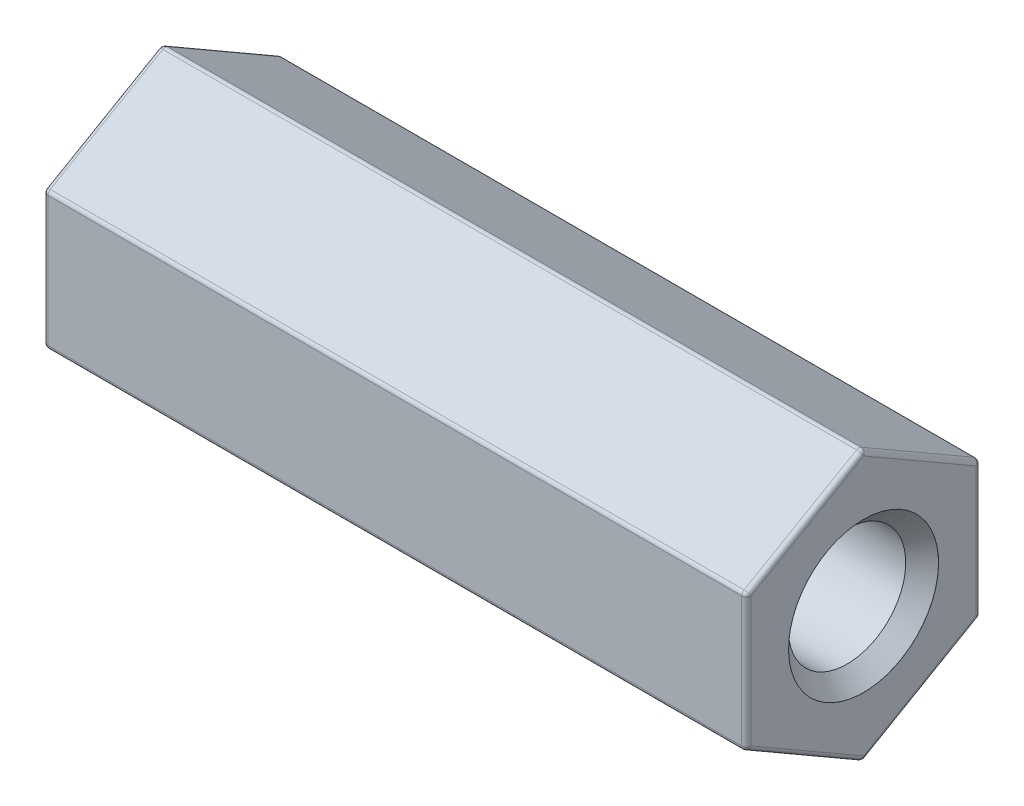
ISO-10303-21;
HEADER;
FILE_DESCRIPTION(('STEP AP214'),'2;1');
FILE_NAME('part.step','',(''),(''),'','','');
FILE_SCHEMA(('AUTOMOTIVE_DESIGN { 1 0 10303 214 1 1 1 1 }'));
ENDSEC;
DATA;
#1=APPLICATION_CONTEXT('core data for automotive mechanical design processes');
#2=APPLICATION_PROTOCOL_DEFINITION('international standard','automotive_design',2000,#1);
#3=PRODUCT_CONTEXT('',#1,'mechanical');
#4=PRODUCT('Part','Part','',(#3));
#5=PRODUCT_RELATED_PRODUCT_CATEGORY('part','',(#4));
#6=PRODUCT_DEFINITION_FORMATION('','',#4);
#7=PRODUCT_DEFINITION_CONTEXT('part definition',#1,'design');
#8=PRODUCT_DEFINITION('design','',#6,#7);
#9=PRODUCT_DEFINITION_SHAPE('','',#8);
#10=(LENGTH_UNIT() NAMED_UNIT(*) SI_UNIT(.MILLI.,.METRE.));
#11=(NAMED_UNIT(*) PLANE_ANGLE_UNIT() SI_UNIT($,.RADIAN.));
#12=(NAMED_UNIT(*) SI_UNIT($,.STERADIAN.) SOLID_ANGLE_UNIT());
#13=UNCERTAINTY_MEASURE_WITH_UNIT(LENGTH_MEASURE(1.E-05),#10,'distance_accuracy_value','');
#14=(GEOMETRIC_REPRESENTATION_CONTEXT(3) GLOBAL_UNCERTAINTY_ASSIGNED_CONTEXT((#13)) GLOBAL_UNIT_ASSIGNED_CONTEXT((#10,
#11,#12)) REPRESENTATION_CONTEXT('',''));
#15=CARTESIAN_POINT('',(0.,0.,0.));
#16=DIRECTION('',(0.,0.,1.));
#17=DIRECTION('',(1.,0.,0.));
#18=AXIS2_PLACEMENT_3D('',#15,#16,#17);
#19=CARTESIAN_POINT('',(15.,-1.3856406460551,-2.4));
#20=DIRECTION('',(-1.,0.,0.));
#21=DIRECTION('',(0.,0.,1.));
#22=AXIS2_PLACEMENT_3D('',#19,#20,#21);
#23=CYLINDRICAL_SURFACE('',#22,0.0999999999999998);
#24=CARTESIAN_POINT('',(14.9,-1.3856406460551,-2.4));
#25=DIRECTION('',(1.,0.,0.));
#26=DIRECTION('',(0.,0.,-1.));
#27=AXIS2_PLACEMENT_3D('',#24,#25,#26);
#28=CIRCLE('',#27,0.0999999999999998);
#29=CARTESIAN_POINT('',(14.9,-1.4722431864336,-2.44999999999991));
#30=VERTEX_POINT('',#29);
#31=CARTESIAN_POINT('',(14.9,-1.3856406460551,-2.5));
#32=VERTEX_POINT('',#31);
#33=EDGE_CURVE('E156',#30,#32,#28,.T.);
#34=ORIENTED_EDGE('',*,*,#33,.F.);
#35=DIRECTION('',(1.,0.,0.));
#36=VECTOR('',#35,1.);
#37=CARTESIAN_POINT('',(15.,-1.47224318643355,-2.45));
#38=LINE('',#37,#36);
#39=CARTESIAN_POINT('',(0.0999999999999994,-1.47224318643355,-2.45));
#40=VERTEX_POINT('',#39);
#41=EDGE_CURVE('E261',#30,#40,#38,.F.);
#42=ORIENTED_EDGE('',*,*,#41,.T.);
#43=CARTESIAN_POINT('',(0.0999999999999994,-1.3856406460551,-2.4));
#44=DIRECTION('',(-1.,0.,0.));
#45=DIRECTION('',(0.,0.,1.));
#46=AXIS2_PLACEMENT_3D('',#43,#44,#45);
#47=CIRCLE('',#46,0.0999999999999998);
#48=CARTESIAN_POINT('',(0.0999999999999994,-1.3856406460551,-2.5));
#49=VERTEX_POINT('',#48);
#50=EDGE_CURVE('E307',#40,#49,#47,.F.);
#51=ORIENTED_EDGE('',*,*,#50,.T.);
#52=DIRECTION('',(1.,0.,0.));
#53=VECTOR('',#52,1.);
#54=CARTESIAN_POINT('',(15.,-1.3856406460551,-2.5));
#55=LINE('',#54,#53);
#56=EDGE_CURVE('E253',#49,#32,#55,.T.);
#57=ORIENTED_EDGE('',*,*,#56,.T.);
#58=EDGE_LOOP('',(#34,#42,#51,#57));
#59=FACE_BOUND('',#58,.T.);
#60=ADVANCED_FACE('F16',(#59),#23,.T.);
#61=CARTESIAN_POINT('',(15.,1.3856406460551,-2.4));
#62=DIRECTION('',(-1.,0.,0.));
#63=DIRECTION('',(0.,0.,1.));
#64=AXIS2_PLACEMENT_3D('',#61,#62,#63);
#65=CYLINDRICAL_SURFACE('',#64,0.0999999999999998);
#66=CARTESIAN_POINT('',(14.9,1.3856406460551,-2.4));
#67=DIRECTION('',(1.,0.,0.));
#68=DIRECTION('',(0.,0.,-1.));
#69=AXIS2_PLACEMENT_3D('',#66,#67,#68);
#70=CIRCLE('',#69,0.0999999999999998);
#71=CARTESIAN_POINT('',(14.9,1.3856406460551,-2.5));
#72=VERTEX_POINT('',#71);
#73=CARTESIAN_POINT('',(14.9,1.47224318643355,-2.45));
#74=VERTEX_POINT('',#73);
#75=EDGE_CURVE('E147',#72,#74,#70,.T.);
#76=ORIENTED_EDGE('',*,*,#75,.F.);
#77=DIRECTION('',(1.,0.,0.));
#78=VECTOR('',#77,1.);
#79=CARTESIAN_POINT('',(15.,1.3856406460551,-2.5));
#80=LINE('',#79,#78);
#81=CARTESIAN_POINT('',(0.0999999999999994,1.3856406460551,-2.5));
#82=VERTEX_POINT('',#81);
#83=EDGE_CURVE('E256',#72,#82,#80,.F.);
#84=ORIENTED_EDGE('',*,*,#83,.T.);
#85=CARTESIAN_POINT('',(0.0999999999999994,1.3856406460551,-2.4));
#86=DIRECTION('',(1.,0.,0.));
#87=DIRECTION('',(0.,0.,-1.));
#88=AXIS2_PLACEMENT_3D('',#85,#86,#87);
#89=CIRCLE('',#88,0.0999999999999998);
#90=CARTESIAN_POINT('',(0.0999999999999994,1.4722431864334,-2.45000000000025));
#91=VERTEX_POINT('',#90);
#92=EDGE_CURVE('E171',#91,#82,#89,.F.);
#93=ORIENTED_EDGE('',*,*,#92,.F.);
#94=DIRECTION('',(1.,0.,0.));
#95=VECTOR('',#94,1.);
#96=CARTESIAN_POINT('',(15.,1.47224318643355,-2.45));
#97=LINE('',#96,#95);
#98=EDGE_CURVE('E169',#91,#74,#97,.T.);
#99=ORIENTED_EDGE('',*,*,#98,.T.);
#100=EDGE_LOOP('',(#76,#84,#93,#99));
#101=FACE_BOUND('',#100,.T.);
#102=ADVANCED_FACE('F170',(#101),#65,.T.);
#103=CARTESIAN_POINT('',(15.,2.77128129211021,0.));
#104=DIRECTION('',(-1.,0.,0.));
#105=DIRECTION('',(0.,0.,1.));
#106=AXIS2_PLACEMENT_3D('',#103,#104,#105);
#107=CYLINDRICAL_SURFACE('',#106,0.1);
#108=CARTESIAN_POINT('',(14.9,2.77128129211021,0.));
#109=DIRECTION('',(1.,0.,0.));
#110=DIRECTION('',(0.,0.,-1.));
#111=AXIS2_PLACEMENT_3D('',#108,#109,#110);
#112=CIRCLE('',#111,0.1);
#113=CARTESIAN_POINT('',(14.9,2.85788383248861,-0.0500000000000736));
#114=VERTEX_POINT('',#113);
#115=CARTESIAN_POINT('',(14.9,2.85788383248865,0.0500000000000005));
#116=VERTEX_POINT('',#115);
#117=EDGE_CURVE('E283',#114,#116,#112,.T.);
#118=ORIENTED_EDGE('',*,*,#117,.F.);
#119=DIRECTION('',(1.,0.,0.));
#120=VECTOR('',#119,1.);
#121=CARTESIAN_POINT('',(15.,2.85788383248865,-0.0499999999999997));
#122=LINE('',#121,#120);
#123=CARTESIAN_POINT('',(0.0999999999999994,2.85788383248865,-0.0499999999999997));
#124=VERTEX_POINT('',#123);
#125=EDGE_CURVE('E140',#114,#124,#122,.F.);
#126=ORIENTED_EDGE('',*,*,#125,.T.);
#127=CARTESIAN_POINT('',(0.0999999999999994,2.77128129211021,0.));
#128=DIRECTION('',(1.,0.,0.));
#129=DIRECTION('',(0.,0.,-1.));
#130=AXIS2_PLACEMENT_3D('',#127,#128,#129);
#131=CIRCLE('',#130,0.1);
#132=CARTESIAN_POINT('',(0.0999999999999994,2.85788383248828,0.0500000000006368));
#133=VERTEX_POINT('',#132);
#134=EDGE_CURVE('E173',#133,#124,#131,.F.);
#135=ORIENTED_EDGE('',*,*,#134,.F.);
#136=DIRECTION('',(1.,0.,0.));
#137=VECTOR('',#136,1.);
#138=CARTESIAN_POINT('',(15.,2.85788383248865,0.0500000000000006));
#139=LINE('',#138,#137);
#140=EDGE_CURVE('E497',#133,#116,#139,.T.);
#141=ORIENTED_EDGE('',*,*,#140,.T.);
#142=EDGE_LOOP('',(#118,#126,#135,#141));
#143=FACE_BOUND('',#142,.T.);
#144=ADVANCED_FACE('F494',(#143),#107,.T.);
#145=CARTESIAN_POINT('',(15.,1.3856406460551,2.4));
#146=DIRECTION('',(-1.,0.,0.));
#147=DIRECTION('',(0.,0.,1.));
#148=AXIS2_PLACEMENT_3D('',#145,#146,#147);
#149=CYLINDRICAL_SURFACE('',#148,0.0999999999999998);
#150=CARTESIAN_POINT('',(14.9,1.3856406460551,2.4));
#151=DIRECTION('',(1.,0.,0.));
#152=DIRECTION('',(0.,0.,-1.));
#153=AXIS2_PLACEMENT_3D('',#150,#151,#152);
#154=CIRCLE('',#153,0.0999999999999998);
#155=CARTESIAN_POINT('',(14.9,1.47224318643357,2.44999999999996));
#156=VERTEX_POINT('',#155);
#157=CARTESIAN_POINT('',(14.9,1.3856406460551,2.5));
#158=VERTEX_POINT('',#157);
#159=EDGE_CURVE('E264',#156,#158,#154,.T.);
#160=ORIENTED_EDGE('',*,*,#159,.F.);
#161=DIRECTION('',(1.,0.,0.));
#162=VECTOR('',#161,1.);
#163=CARTESIAN_POINT('',(15.,1.47224318643355,2.45));
#164=LINE('',#163,#162);
#165=CARTESIAN_POINT('',(0.0999999999999994,1.47224318643355,2.45));
#166=VERTEX_POINT('',#165);
#167=EDGE_CURVE('E235',#156,#166,#164,.F.);
#168=ORIENTED_EDGE('',*,*,#167,.T.);
#169=CARTESIAN_POINT('',(0.0999999999999994,1.3856406460551,2.4));
#170=DIRECTION('',(1.,0.,0.));
#171=DIRECTION('',(0.,0.,-1.));
#172=AXIS2_PLACEMENT_3D('',#169,#170,#171);
#173=CIRCLE('',#172,0.0999999999999998);
#174=CARTESIAN_POINT('',(0.0999999999999994,1.38564064605472,2.5));
#175=VERTEX_POINT('',#174);
#176=EDGE_CURVE('E214',#175,#166,#173,.F.);
#177=ORIENTED_EDGE('',*,*,#176,.F.);
#178=DIRECTION('',(-1.,0.,0.));
#179=VECTOR('',#178,1.);
#180=CARTESIAN_POINT('',(15.,1.3856406460551,2.5));
#181=LINE('',#180,#179);
#182=EDGE_CURVE('E211',#175,#158,#181,.F.);
#183=ORIENTED_EDGE('',*,*,#182,.T.);
#184=EDGE_LOOP('',(#160,#168,#177,#183));
#185=FACE_BOUND('',#184,.T.);
#186=ADVANCED_FACE('F686',(#185),#149,.T.);
#187=CARTESIAN_POINT('',(15.,-2.77128129211021,0.));
#188=DIRECTION('',(-1.,0.,0.));
#189=DIRECTION('',(0.,0.,1.));
#190=AXIS2_PLACEMENT_3D('',#187,#188,#189);
#191=CYLINDRICAL_SURFACE('',#190,0.1);
#192=CARTESIAN_POINT('',(14.9,-2.77128129211021,0.));
#193=DIRECTION('',(1.,0.,0.));
#194=DIRECTION('',(0.,0.,-1.));
#195=AXIS2_PLACEMENT_3D('',#192,#193,#194);
#196=CIRCLE('',#195,0.1);
#197=CARTESIAN_POINT('',(14.9,-2.85788383248887,0.0499999999996142));
#198=VERTEX_POINT('',#197);
#199=CARTESIAN_POINT('',(14.9,-2.85788383248865,-0.0499999999999997));
#200=VERTEX_POINT('',#199);
#201=EDGE_CURVE('E288',#198,#200,#196,.T.);
#202=ORIENTED_EDGE('',*,*,#201,.F.);
#203=DIRECTION('',(1.,0.,0.));
#204=VECTOR('',#203,1.);
#205=CARTESIAN_POINT('',(15.,-2.85788383248865,0.0500000000000006));
#206=LINE('',#205,#204);
#207=CARTESIAN_POINT('',(0.0999999999999994,-2.85788383248865,0.0500000000000006));
#208=VERTEX_POINT('',#207);
#209=EDGE_CURVE('E205',#198,#208,#206,.F.);
#210=ORIENTED_EDGE('',*,*,#209,.T.);
#211=CARTESIAN_POINT('',(0.0999999999999994,-2.77128129211021,0.));
#212=DIRECTION('',(1.,0.,0.));
#213=DIRECTION('',(0.,0.,-1.));
#214=AXIS2_PLACEMENT_3D('',#211,#212,#213);
#215=CIRCLE('',#214,0.1);
#216=CARTESIAN_POINT('',(0.0999999999999994,-2.85788383248875,-0.0499999999998183));
#217=VERTEX_POINT('',#216);
#218=EDGE_CURVE('E206',#217,#208,#215,.F.);
#219=ORIENTED_EDGE('',*,*,#218,.F.);
#220=DIRECTION('',(1.,0.,0.));
#221=VECTOR('',#220,1.);
#222=CARTESIAN_POINT('',(15.,-2.85788383248865,-0.0499999999999997));
#223=LINE('',#222,#221);
#224=EDGE_CURVE('E258',#217,#200,#223,.T.);
#225=ORIENTED_EDGE('',*,*,#224,.T.);
#226=EDGE_LOOP('',(#202,#210,#219,#225));
#227=FACE_BOUND('',#226,.T.);
#228=ADVANCED_FACE('F470',(#227),#191,.T.);
#229=CARTESIAN_POINT('',(15.,-1.3856406460551,2.4));
#230=DIRECTION('',(-1.,0.,0.));
#231=DIRECTION('',(0.,0.,1.));
#232=AXIS2_PLACEMENT_3D('',#229,#230,#231);
#233=CYLINDRICAL_SURFACE('',#232,0.0999999999999998);
#234=CARTESIAN_POINT('',(14.9,-1.3856406460551,2.4));
#235=DIRECTION('',(1.,0.,0.));
#236=DIRECTION('',(0.,0.,-1.));
#237=AXIS2_PLACEMENT_3D('',#234,#235,#236);
#238=CIRCLE('',#237,0.0999999999999998);
#239=CARTESIAN_POINT('',(14.9,-1.38564064605529,2.5));
#240=VERTEX_POINT('',#239);
#241=CARTESIAN_POINT('',(14.9,-1.47224318643355,2.45));
#242=VERTEX_POINT('',#241);
#243=EDGE_CURVE('E284',#240,#242,#238,.T.);
#244=ORIENTED_EDGE('',*,*,#243,.F.);
#245=DIRECTION('',(-1.,0.,0.));
#246=VECTOR('',#245,1.);
#247=CARTESIAN_POINT('',(15.,-1.3856406460551,2.5));
#248=LINE('',#247,#246);
#249=CARTESIAN_POINT('',(0.0999999999999994,-1.3856406460551,2.5));
#250=VERTEX_POINT('',#249);
#251=EDGE_CURVE('E208',#240,#250,#248,.T.);
#252=ORIENTED_EDGE('',*,*,#251,.T.);
#253=CARTESIAN_POINT('',(0.0999999999999994,-1.3856406460551,2.4));
#254=DIRECTION('',(-1.,0.,0.));
#255=DIRECTION('',(0.,0.,1.));
#256=AXIS2_PLACEMENT_3D('',#253,#254,#255);
#257=CIRCLE('',#256,0.0999999999999998);
#258=CARTESIAN_POINT('',(0.0999999999999994,-1.47224318643352,2.45000000000004));
#259=VERTEX_POINT('',#258);
#260=EDGE_CURVE('E157',#250,#259,#257,.F.);
#261=ORIENTED_EDGE('',*,*,#260,.T.);
#262=DIRECTION('',(1.,0.,0.));
#263=VECTOR('',#262,1.);
#264=CARTESIAN_POINT('',(15.,-1.47224318643355,2.45));
#265=LINE('',#264,#263);
#266=EDGE_CURVE('E166',#259,#242,#265,.T.);
#267=ORIENTED_EDGE('',*,*,#266,.T.);
#268=EDGE_LOOP('',(#244,#252,#261,#267));
#269=FACE_BOUND('',#268,.T.);
#270=ADVANCED_FACE('F476',(#269),#233,.T.);
#271=CARTESIAN_POINT('',(14.9,1.3856406460551,-2.4));
#272=DIRECTION('',(1.,0.,0.));
#273=DIRECTION('',(0.,0.,-1.));
#274=AXIS2_PLACEMENT_3D('',#271,#272,#273);
#275=SPHERICAL_SURFACE('',#274,0.1);
#276=ORIENTED_EDGE('',*,*,#75,.T.);
#277=CARTESIAN_POINT('',(14.9,1.3856406460551,-2.4));
#278=DIRECTION('',(0.,0.5,0.866025403784439));
#279=DIRECTION('',(0.,-0.866025403784439,0.5));
#280=AXIS2_PLACEMENT_3D('',#277,#278,#279);
#281=CIRCLE('',#280,0.0999999999999998);
#282=CARTESIAN_POINT('',(15.,1.3856406460551,-2.4));
#283=VERTEX_POINT('',#282);
#284=EDGE_CURVE('E150',#283,#74,#281,.T.);
#285=ORIENTED_EDGE('',*,*,#284,.F.);
#286=CARTESIAN_POINT('',(14.9,1.3856406460551,-2.4));
#287=DIRECTION('',(0.,1.,0.));
#288=DIRECTION('',(0.,0.,1.));
#289=AXIS2_PLACEMENT_3D('',#286,#287,#288);
#290=CIRCLE('',#289,0.0999999999999998);
#291=EDGE_CURVE('E152',#72,#283,#290,.F.);
#292=ORIENTED_EDGE('',*,*,#291,.F.);
#293=EDGE_LOOP('',(#276,#285,#292));
#294=FACE_BOUND('',#293,.T.);
#295=ADVANCED_FACE('F149',(#294),#275,.T.);
#296=CARTESIAN_POINT('',(14.9,-1.3856406460551,-2.4));
#297=DIRECTION('',(1.,0.,0.));
#298=DIRECTION('',(0.,0.,-1.));
#299=AXIS2_PLACEMENT_3D('',#296,#297,#298);
#300=SPHERICAL_SURFACE('',#299,0.1);
#301=CARTESIAN_POINT('',(14.9,-1.3856406460551,-2.4));
#302=DIRECTION('',(0.,1.,0.));
#303=DIRECTION('',(0.,0.,1.));
#304=AXIS2_PLACEMENT_3D('',#301,#302,#303);
#305=CIRCLE('',#304,0.0999999999999998);
#306=CARTESIAN_POINT('',(15.,-1.3856406460551,-2.4));
#307=VERTEX_POINT('',#306);
#308=EDGE_CURVE('E178',#307,#32,#305,.T.);
#309=ORIENTED_EDGE('',*,*,#308,.F.);
#310=CARTESIAN_POINT('',(14.9,-1.3856406460551,-2.4));
#311=DIRECTION('',(0.,0.5,-0.866025403784439));
#312=DIRECTION('',(0.,0.866025403784439,0.5));
#313=AXIS2_PLACEMENT_3D('',#310,#311,#312);
#314=CIRCLE('',#313,0.1);
#315=EDGE_CURVE('E430',#30,#307,#314,.F.);
#316=ORIENTED_EDGE('',*,*,#315,.F.);
#317=ORIENTED_EDGE('',*,*,#33,.T.);
#318=EDGE_LOOP('',(#309,#316,#317));
#319=FACE_BOUND('',#318,.T.);
#320=ADVANCED_FACE('F295',(#319),#300,.T.);
#321=CARTESIAN_POINT('',(14.9,-2.77128129211021,0.));
#322=DIRECTION('',(1.,0.,0.));
#323=DIRECTION('',(0.,0.,-1.));
#324=AXIS2_PLACEMENT_3D('',#321,#322,#323);
#325=SPHERICAL_SURFACE('',#324,0.1);
#326=CARTESIAN_POINT('',(14.9,-2.77128129211021,0.));
#327=DIRECTION('',(0.,0.5,-0.866025403784439));
#328=DIRECTION('',(0.,0.866025403784439,0.5));
#329=AXIS2_PLACEMENT_3D('',#326,#327,#328);
#330=CIRCLE('',#329,0.1);
#331=CARTESIAN_POINT('',(15.,-2.7712812921102,0.));
#332=VERTEX_POINT('',#331);
#333=EDGE_CURVE('E427',#332,#200,#330,.T.);
#334=ORIENTED_EDGE('',*,*,#333,.F.);
#335=CARTESIAN_POINT('',(14.9,-2.77128129211021,0.));
#336=DIRECTION('',(0.,-0.5,-0.866025403784439));
#337=DIRECTION('',(0.,0.866025403784439,-0.5));
#338=AXIS2_PLACEMENT_3D('',#335,#336,#337);
#339=CIRCLE('',#338,0.0999999999999998);
#340=EDGE_CURVE('E422',#198,#332,#339,.F.);
#341=ORIENTED_EDGE('',*,*,#340,.F.);
#342=ORIENTED_EDGE('',*,*,#201,.T.);
#343=EDGE_LOOP('',(#334,#341,#342));
#344=FACE_BOUND('',#343,.T.);
#345=ADVANCED_FACE('F292',(#344),#325,.T.);
#346=CARTESIAN_POINT('',(14.9,-1.3856406460551,2.4));
#347=DIRECTION('',(1.,0.,0.));
#348=DIRECTION('',(0.,0.,-1.));
#349=AXIS2_PLACEMENT_3D('',#346,#347,#348);
#350=SPHERICAL_SURFACE('',#349,0.1);
#351=CARTESIAN_POINT('',(14.9,-1.3856406460551,2.4));
#352=DIRECTION('',(0.,-0.5,-0.866025403784439));
#353=DIRECTION('',(0.,0.866025403784439,-0.5));
#354=AXIS2_PLACEMENT_3D('',#351,#352,#353);
#355=CIRCLE('',#354,0.0999999999999998);
#356=CARTESIAN_POINT('',(15.,-1.3856406460551,2.4));
#357=VERTEX_POINT('',#356);
#358=EDGE_CURVE('E419',#357,#242,#355,.T.);
#359=ORIENTED_EDGE('',*,*,#358,.F.);
#360=CARTESIAN_POINT('',(14.9,-1.3856406460551,2.4));
#361=DIRECTION('',(0.,-1.,0.));
#362=DIRECTION('',(1.,0.,0.));
#363=AXIS2_PLACEMENT_3D('',#360,#361,#362);
#364=CIRCLE('',#363,0.0999999999999994);
#365=EDGE_CURVE('E408',#240,#357,#364,.F.);
#366=ORIENTED_EDGE('',*,*,#365,.F.);
#367=ORIENTED_EDGE('',*,*,#243,.T.);
#368=EDGE_LOOP('',(#359,#366,#367));
#369=FACE_BOUND('',#368,.T.);
#370=ADVANCED_FACE('F277',(#369),#350,.T.);
#371=CARTESIAN_POINT('',(14.9,2.77128129211021,0.));
#372=DIRECTION('',(1.,0.,0.));
#373=DIRECTION('',(0.,0.,-1.));
#374=AXIS2_PLACEMENT_3D('',#371,#372,#373);
#375=SPHERICAL_SURFACE('',#374,0.1);
#376=ORIENTED_EDGE('',*,*,#117,.T.);
#377=CARTESIAN_POINT('',(14.9,2.77128129211021,0.));
#378=DIRECTION('',(0.,-0.5,0.866025403784439));
#379=DIRECTION('',(0.,-0.866025403784439,-0.5));
#380=AXIS2_PLACEMENT_3D('',#377,#378,#379);
#381=CIRCLE('',#380,0.0999999999999998);
#382=CARTESIAN_POINT('',(15.,2.77128129211021,0.));
#383=VERTEX_POINT('',#382);
#384=EDGE_CURVE('E405',#383,#116,#381,.T.);
#385=ORIENTED_EDGE('',*,*,#384,.F.);
#386=CARTESIAN_POINT('',(14.9,2.77128129211021,0.));
#387=DIRECTION('',(0.,0.5,0.866025403784439));
#388=DIRECTION('',(0.,-0.866025403784439,0.5));
#389=AXIS2_PLACEMENT_3D('',#386,#387,#388);
#390=CIRCLE('',#389,0.0999999999999998);
#391=EDGE_CURVE('E176',#114,#383,#390,.F.);
#392=ORIENTED_EDGE('',*,*,#391,.F.);
#393=EDGE_LOOP('',(#376,#385,#392));
#394=FACE_BOUND('',#393,.T.);
#395=ADVANCED_FACE('F273',(#394),#375,.T.);
#396=CARTESIAN_POINT('',(14.9,1.3856406460551,2.4));
#397=DIRECTION('',(1.,0.,0.));
#398=DIRECTION('',(0.,0.,-1.));
#399=AXIS2_PLACEMENT_3D('',#396,#397,#398);
#400=SPHERICAL_SURFACE('',#399,0.1);
#401=ORIENTED_EDGE('',*,*,#159,.T.);
#402=CARTESIAN_POINT('',(14.9,1.3856406460551,2.4));
#403=DIRECTION('',(0.,-1.,0.));
#404=DIRECTION('',(1.,0.,0.));
#405=AXIS2_PLACEMENT_3D('',#402,#403,#404);
#406=CIRCLE('',#405,0.0999999999999994);
#407=CARTESIAN_POINT('',(15.,1.3856406460551,2.4));
#408=VERTEX_POINT('',#407);
#409=EDGE_CURVE('E413',#408,#158,#406,.T.);
#410=ORIENTED_EDGE('',*,*,#409,.F.);
#411=CARTESIAN_POINT('',(14.9,1.3856406460551,2.4));
#412=DIRECTION('',(0.,-0.5,0.866025403784439));
#413=DIRECTION('',(0.,-0.866025403784439,-0.5));
#414=AXIS2_PLACEMENT_3D('',#411,#412,#413);
#415=CIRCLE('',#414,0.0999999999999998);
#416=EDGE_CURVE('E400',#156,#408,#415,.F.);
#417=ORIENTED_EDGE('',*,*,#416,.F.);
#418=EDGE_LOOP('',(#401,#410,#417));
#419=FACE_BOUND('',#418,.T.);
#420=ADVANCED_FACE('F269',(#419),#400,.T.);
#421=CARTESIAN_POINT('',(15.,-2.88675134594813,0.));
#422=DIRECTION('',(0.,0.866025403784439,0.5));
#423=DIRECTION('',(0.,-0.5,0.866025403784439));
#424=AXIS2_PLACEMENT_3D('',#421,#422,#423);
#425=PLANE('',#424);
#426=ORIENTED_EDGE('',*,*,#224,.F.);
#427=DIRECTION('',(0.,0.5,-0.866025403784439));
#428=VECTOR('',#427,1.);
#429=CARTESIAN_POINT('',(0.0999999999999994,-2.88675134594813,0.));
#430=LINE('',#429,#428);
#431=EDGE_CURVE('E394',#40,#217,#430,.F.);
#432=ORIENTED_EDGE('',*,*,#431,.F.);
#433=ORIENTED_EDGE('',*,*,#41,.F.);
#434=DIRECTION('',(0.,0.5,-0.866025403784439));
#435=VECTOR('',#434,1.);
#436=CARTESIAN_POINT('',(14.9,-2.1650635094611,-1.25));
#437=LINE('',#436,#435);
#438=EDGE_CURVE('E424',#200,#30,#437,.T.);
#439=ORIENTED_EDGE('',*,*,#438,.F.);
#440=EDGE_LOOP('',(#426,#432,#433,#439));
#441=FACE_BOUND('',#440,.T.);
#442=ADVANCED_FACE('F272',(#441),#425,.F.);
#443=CARTESIAN_POINT('',(15.,-1.44337567297407,-2.5));
#444=DIRECTION('',(0.,0.,1.));
#445=DIRECTION('',(0.,-1.,0.));
#446=AXIS2_PLACEMENT_3D('',#443,#444,#445);
#447=PLANE('',#446);
#448=ORIENTED_EDGE('',*,*,#56,.F.);
#449=DIRECTION('',(0.,1.,0.));
#450=VECTOR('',#449,1.);
#451=CARTESIAN_POINT('',(0.0999999999999994,-1.44337567297407,-2.5));
#452=LINE('',#451,#450);
#453=EDGE_CURVE('E386',#82,#49,#452,.F.);
#454=ORIENTED_EDGE('',*,*,#453,.F.);
#455=ORIENTED_EDGE('',*,*,#83,.F.);
#456=DIRECTION('',(0.,1.,0.));
#457=VECTOR('',#456,1.);
#458=CARTESIAN_POINT('',(14.9,0.,-2.5));
#459=LINE('',#458,#457);
#460=EDGE_CURVE('E433',#32,#72,#459,.T.);
#461=ORIENTED_EDGE('',*,*,#460,.F.);
#462=EDGE_LOOP('',(#448,#454,#455,#461));
#463=FACE_BOUND('',#462,.T.);
#464=ADVANCED_FACE('F248',(#463),#447,.F.);
#465=CARTESIAN_POINT('',(0.1,-1.3856406460551,-2.4));
#466=DIRECTION('',(1.,0.,0.));
#467=DIRECTION('',(0.,0.,-1.));
#468=AXIS2_PLACEMENT_3D('',#465,#466,#467);
#469=SPHERICAL_SURFACE('',#468,0.1);
#470=CARTESIAN_POINT('',(0.0999999999999994,-1.3856406460551,-2.4));
#471=DIRECTION('',(0.,1.,0.));
#472=DIRECTION('',(0.,0.,1.));
#473=AXIS2_PLACEMENT_3D('',#470,#471,#472);
#474=CIRCLE('',#473,0.0999999999999998);
#475=CARTESIAN_POINT('',(0.,-1.3856406460551,-2.4));
#476=VERTEX_POINT('',#475);
#477=EDGE_CURVE('E384',#49,#476,#474,.T.);
#478=ORIENTED_EDGE('',*,*,#477,.F.);
#479=ORIENTED_EDGE('',*,*,#50,.F.);
#480=CARTESIAN_POINT('',(0.0999999999999992,-1.3856406460551,-2.4));
#481=DIRECTION('',(0.,0.5,-0.866025403784439));
#482=DIRECTION('',(0.,0.866025403784439,0.5));
#483=AXIS2_PLACEMENT_3D('',#480,#481,#482);
#484=CIRCLE('',#483,0.0999999999999998);
#485=EDGE_CURVE('E397',#476,#40,#484,.F.);
#486=ORIENTED_EDGE('',*,*,#485,.F.);
#487=EDGE_LOOP('',(#478,#479,#486));
#488=FACE_BOUND('',#487,.T.);
#489=ADVANCED_FACE('F244',(#488),#469,.T.);
#490=CARTESIAN_POINT('',(0.1,1.3856406460551,-2.4));
#491=DIRECTION('',(1.,0.,0.));
#492=DIRECTION('',(0.,0.,-1.));
#493=AXIS2_PLACEMENT_3D('',#490,#491,#492);
#494=SPHERICAL_SURFACE('',#493,0.1);
#495=CARTESIAN_POINT('',(0.099999999999999,1.3856406460551,-2.4));
#496=DIRECTION('',(0.,1.,0.));
#497=DIRECTION('',(0.,0.,1.));
#498=AXIS2_PLACEMENT_3D('',#495,#496,#497);
#499=CIRCLE('',#498,0.0999999999999998);
#500=CARTESIAN_POINT('',(0.,1.3856406460551,-2.4));
#501=VERTEX_POINT('',#500);
#502=EDGE_CURVE('E389',#501,#82,#499,.F.);
#503=ORIENTED_EDGE('',*,*,#502,.F.);
#504=CARTESIAN_POINT('',(0.0999999999999994,1.3856406460551,-2.4));
#505=DIRECTION('',(0.,0.5,0.866025403784439));
#506=DIRECTION('',(0.,-0.866025403784439,0.5));
#507=AXIS2_PLACEMENT_3D('',#504,#505,#506);
#508=CIRCLE('',#507,0.1);
#509=EDGE_CURVE('E382',#91,#501,#508,.T.);
#510=ORIENTED_EDGE('',*,*,#509,.F.);
#511=ORIENTED_EDGE('',*,*,#92,.T.);
#512=EDGE_LOOP('',(#503,#510,#511));
#513=FACE_BOUND('',#512,.T.);
#514=ADVANCED_FACE('F241',(#513),#494,.T.);
#515=CARTESIAN_POINT('',(15.,1.44337567297407,-2.5));
#516=DIRECTION('',(0.,-0.866025403784439,0.5));
#517=DIRECTION('',(0.,-0.5,-0.866025403784439));
#518=AXIS2_PLACEMENT_3D('',#515,#516,#517);
#519=PLANE('',#518);
#520=ORIENTED_EDGE('',*,*,#98,.F.);
#521=DIRECTION('',(0.,0.5,0.866025403784439));
#522=VECTOR('',#521,1.);
#523=CARTESIAN_POINT('',(0.0999999999999994,1.44337567297407,-2.5));
#524=LINE('',#523,#522);
#525=EDGE_CURVE('E377',#124,#91,#524,.F.);
#526=ORIENTED_EDGE('',*,*,#525,.F.);
#527=ORIENTED_EDGE('',*,*,#125,.F.);
#528=DIRECTION('',(0.,0.5,0.866025403784439));
#529=VECTOR('',#528,1.);
#530=CARTESIAN_POINT('',(14.9,2.1650635094611,-1.25));
#531=LINE('',#530,#529);
#532=EDGE_CURVE('E162',#74,#114,#531,.T.);
#533=ORIENTED_EDGE('',*,*,#532,.F.);
#534=EDGE_LOOP('',(#520,#526,#527,#533));
#535=FACE_BOUND('',#534,.T.);
#536=ADVANCED_FACE('F175',(#535),#519,.F.);
#537=CARTESIAN_POINT('',(0.0999999999999999,2.77128129211021,0.));
#538=DIRECTION('',(1.,0.,0.));
#539=DIRECTION('',(0.,0.,-1.));
#540=AXIS2_PLACEMENT_3D('',#537,#538,#539);
#541=SPHERICAL_SURFACE('',#540,0.1);
#542=CARTESIAN_POINT('',(0.0999999999999992,2.77128129211021,0.));
#543=DIRECTION('',(0.,0.5,0.866025403784439));
#544=DIRECTION('',(0.,-0.866025403784439,0.5));
#545=AXIS2_PLACEMENT_3D('',#542,#543,#544);
#546=CIRCLE('',#545,0.1);
#547=CARTESIAN_POINT('',(0.,2.77128129211021,0.));
#548=VERTEX_POINT('',#547);
#549=EDGE_CURVE('E379',#548,#124,#546,.F.);
#550=ORIENTED_EDGE('',*,*,#549,.F.);
#551=CARTESIAN_POINT('',(0.0999999999999994,2.77128129211021,0.));
#552=DIRECTION('',(0.,-0.5,0.866025403784439));
#553=DIRECTION('',(0.,-0.866025403784439,-0.5));
#554=AXIS2_PLACEMENT_3D('',#551,#552,#553);
#555=CIRCLE('',#554,0.0999999999999998);
#556=EDGE_CURVE('E375',#133,#548,#555,.T.);
#557=ORIENTED_EDGE('',*,*,#556,.F.);
#558=ORIENTED_EDGE('',*,*,#134,.T.);
#559=EDGE_LOOP('',(#550,#557,#558));
#560=FACE_BOUND('',#559,.T.);
#561=ADVANCED_FACE('F225',(#560),#541,.T.);
#562=CARTESIAN_POINT('',(15.,2.88675134594813,0.));
#563=DIRECTION('',(0.,-0.866025403784439,-0.5));
#564=DIRECTION('',(0.,0.5,-0.866025403784439));
#565=AXIS2_PLACEMENT_3D('',#562,#563,#564);
#566=PLANE('',#565);
#567=ORIENTED_EDGE('',*,*,#140,.F.);
#568=DIRECTION('',(0.,-0.5,0.866025403784439));
#569=VECTOR('',#568,1.);
#570=CARTESIAN_POINT('',(0.0999999999999994,2.88675134594813,0.));
#571=LINE('',#570,#569);
#572=EDGE_CURVE('E369',#166,#133,#571,.F.);
#573=ORIENTED_EDGE('',*,*,#572,.F.);
#574=ORIENTED_EDGE('',*,*,#167,.F.);
#575=DIRECTION('',(0.,-0.5,0.866025403784439));
#576=VECTOR('',#575,1.);
#577=CARTESIAN_POINT('',(14.9,2.1650635094611,1.25));
#578=LINE('',#577,#576);
#579=EDGE_CURVE('E402',#116,#156,#578,.T.);
#580=ORIENTED_EDGE('',*,*,#579,.F.);
#581=EDGE_LOOP('',(#567,#573,#574,#580));
#582=FACE_BOUND('',#581,.T.);
#583=ADVANCED_FACE('F221',(#582),#566,.F.);
#584=CARTESIAN_POINT('',(0.1,1.3856406460551,2.4));
#585=DIRECTION('',(1.,0.,0.));
#586=DIRECTION('',(0.,0.,-1.));
#587=AXIS2_PLACEMENT_3D('',#584,#585,#586);
#588=SPHERICAL_SURFACE('',#587,0.1);
#589=CARTESIAN_POINT('',(0.0999999999999994,1.3856406460551,2.4));
#590=DIRECTION('',(0.,-1.,0.));
#591=DIRECTION('',(1.,0.,0.));
#592=AXIS2_PLACEMENT_3D('',#589,#590,#591);
#593=CIRCLE('',#592,0.1);
#594=CARTESIAN_POINT('',(0.,1.3856406460551,2.4));
#595=VERTEX_POINT('',#594);
#596=EDGE_CURVE('E367',#175,#595,#593,.T.);
#597=ORIENTED_EDGE('',*,*,#596,.F.);
#598=ORIENTED_EDGE('',*,*,#176,.T.);
#599=CARTESIAN_POINT('',(0.0999999999999996,1.3856406460551,2.4));
#600=DIRECTION('',(0.,-0.5,0.866025403784439));
#601=DIRECTION('',(0.,-0.866025403784439,-0.5));
#602=AXIS2_PLACEMENT_3D('',#599,#600,#601);
#603=CIRCLE('',#602,0.0999999999999998);
#604=EDGE_CURVE('E372',#595,#166,#603,.F.);
#605=ORIENTED_EDGE('',*,*,#604,.F.);
#606=EDGE_LOOP('',(#597,#598,#605));
#607=FACE_BOUND('',#606,.T.);
#608=ADVANCED_FACE('F218',(#607),#588,.T.);
#609=CARTESIAN_POINT('',(15.,1.44337567297407,2.5));
#610=DIRECTION('',(0.,0.,-1.));
#611=DIRECTION('',(-1.,0.,0.));
#612=AXIS2_PLACEMENT_3D('',#609,#610,#611);
#613=PLANE('',#612);
#614=ORIENTED_EDGE('',*,*,#251,.F.);
#615=DIRECTION('',(0.,-1.,0.));
#616=VECTOR('',#615,1.);
#617=CARTESIAN_POINT('',(14.9,0.,2.5));
#618=LINE('',#617,#616);
#619=EDGE_CURVE('E410',#158,#240,#618,.T.);
#620=ORIENTED_EDGE('',*,*,#619,.F.);
#621=ORIENTED_EDGE('',*,*,#182,.F.);
#622=DIRECTION('',(0.,-1.,0.));
#623=VECTOR('',#622,1.);
#624=CARTESIAN_POINT('',(0.0999999999999994,1.44337567297406,2.5));
#625=LINE('',#624,#623);
#626=EDGE_CURVE('E361',#250,#175,#625,.F.);
#627=ORIENTED_EDGE('',*,*,#626,.F.);
#628=EDGE_LOOP('',(#614,#620,#621,#627));
#629=FACE_BOUND('',#628,.T.);
#630=ADVANCED_FACE('F200',(#629),#613,.F.);
#631=CARTESIAN_POINT('',(0.100000000000001,-2.77128129211021,0.));
#632=DIRECTION('',(1.,0.,0.));
#633=DIRECTION('',(0.,0.,-1.));
#634=AXIS2_PLACEMENT_3D('',#631,#632,#633);
#635=SPHERICAL_SURFACE('',#634,0.1);
#636=CARTESIAN_POINT('',(0.0999999999999994,-2.77128129211021,0.));
#637=DIRECTION('',(0.,0.5,-0.866025403784439));
#638=DIRECTION('',(0.,0.866025403784439,0.5));
#639=AXIS2_PLACEMENT_3D('',#636,#637,#638);
#640=CIRCLE('',#639,0.0999999999999998);
#641=CARTESIAN_POINT('',(0.,-2.7712812921102,0.));
#642=VERTEX_POINT('',#641);
#643=EDGE_CURVE('E392',#217,#642,#640,.T.);
#644=ORIENTED_EDGE('',*,*,#643,.F.);
#645=ORIENTED_EDGE('',*,*,#218,.T.);
#646=CARTESIAN_POINT('',(0.0999999999999996,-2.77128129211021,0.));
#647=DIRECTION('',(0.,-0.5,-0.866025403784439));
#648=DIRECTION('',(0.,0.866025403784439,-0.5));
#649=AXIS2_PLACEMENT_3D('',#646,#647,#648);
#650=CIRCLE('',#649,0.1);
#651=EDGE_CURVE('E359',#642,#208,#650,.F.);
#652=ORIENTED_EDGE('',*,*,#651,.F.);
#653=EDGE_LOOP('',(#644,#645,#652));
#654=FACE_BOUND('',#653,.T.);
#655=ADVANCED_FACE('F195',(#654),#635,.T.);
#656=CARTESIAN_POINT('',(15.,-1.44337567297407,2.5));
#657=DIRECTION('',(0.,0.866025403784439,-0.5));
#658=DIRECTION('',(0.,0.5,0.866025403784439));
#659=AXIS2_PLACEMENT_3D('',#656,#657,#658);
#660=PLANE('',#659);
#661=ORIENTED_EDGE('',*,*,#266,.F.);
#662=DIRECTION('',(0.,-0.5,-0.866025403784439));
#663=VECTOR('',#662,1.);
#664=CARTESIAN_POINT('',(0.0999999999999994,-1.44337567297407,2.5));
#665=LINE('',#664,#663);
#666=EDGE_CURVE('E357',#208,#259,#665,.F.);
#667=ORIENTED_EDGE('',*,*,#666,.F.);
#668=ORIENTED_EDGE('',*,*,#209,.F.);
#669=DIRECTION('',(0.,-0.5,-0.866025403784439));
#670=VECTOR('',#669,1.);
#671=CARTESIAN_POINT('',(14.9,-2.1650635094611,1.25));
#672=LINE('',#671,#670);
#673=EDGE_CURVE('E416',#242,#198,#672,.T.);
#674=ORIENTED_EDGE('',*,*,#673,.F.);
#675=EDGE_LOOP('',(#661,#667,#668,#674));
#676=FACE_BOUND('',#675,.T.);
#677=ADVANCED_FACE('F190',(#676),#660,.F.);
#678=CARTESIAN_POINT('',(0.1,-1.3856406460551,2.4));
#679=DIRECTION('',(1.,0.,0.));
#680=DIRECTION('',(0.,0.,-1.));
#681=AXIS2_PLACEMENT_3D('',#678,#679,#680);
#682=SPHERICAL_SURFACE('',#681,0.1);
#683=CARTESIAN_POINT('',(0.0999999999999994,-1.3856406460551,2.4));
#684=DIRECTION('',(0.,-0.5,-0.866025403784439));
#685=DIRECTION('',(0.,0.866025403784439,-0.5));
#686=AXIS2_PLACEMENT_3D('',#683,#684,#685);
#687=CIRCLE('',#686,0.1);
#688=CARTESIAN_POINT('',(0.,-1.3856406460551,2.4));
#689=VERTEX_POINT('',#688);
#690=EDGE_CURVE('E34',#259,#689,#687,.T.);
#691=ORIENTED_EDGE('',*,*,#690,.F.);
#692=ORIENTED_EDGE('',*,*,#260,.F.);
#693=CARTESIAN_POINT('',(0.0999999999999997,-1.3856406460551,2.4));
#694=DIRECTION('',(0.,-1.,0.));
#695=DIRECTION('',(1.,0.,0.));
#696=AXIS2_PLACEMENT_3D('',#693,#694,#695);
#697=CIRCLE('',#696,0.1);
#698=EDGE_CURVE('E364',#689,#250,#697,.F.);
#699=ORIENTED_EDGE('',*,*,#698,.F.);
#700=EDGE_LOOP('',(#691,#692,#699));
#701=FACE_BOUND('',#700,.T.);
#702=ADVANCED_FACE('F186',(#701),#682,.T.);
#703=CARTESIAN_POINT('',(14.9,2.07846096908265,-1.2));
#704=DIRECTION('',(0.,0.5,0.866025403784439));
#705=DIRECTION('',(0.,-0.866025403784439,0.5));
#706=AXIS2_PLACEMENT_3D('',#703,#704,#705);
#707=CYLINDRICAL_SURFACE('',#706,0.0999999999999998);
#708=ORIENTED_EDGE('',*,*,#391,.T.);
#709=DIRECTION('',(0.,-0.5,-0.866025403784439));
#710=VECTOR('',#709,1.);
#711=CARTESIAN_POINT('',(15.,2.77128129211021,0.));
#712=LINE('',#711,#710);
#713=EDGE_CURVE('E165',#383,#283,#712,.T.);
#714=ORIENTED_EDGE('',*,*,#713,.T.);
#715=ORIENTED_EDGE('',*,*,#284,.T.);
#716=ORIENTED_EDGE('',*,*,#532,.T.);
#717=EDGE_LOOP('',(#708,#714,#715,#716));
#718=FACE_BOUND('',#717,.T.);
#719=ADVANCED_FACE('F161',(#718),#707,.T.);
#720=CARTESIAN_POINT('',(14.9,0.,-2.4));
#721=DIRECTION('',(0.,1.,0.));
#722=DIRECTION('',(0.,0.,1.));
#723=AXIS2_PLACEMENT_3D('',#720,#721,#722);
#724=CYLINDRICAL_SURFACE('',#723,0.0999999999999998);
#725=ORIENTED_EDGE('',*,*,#291,.T.);
#726=DIRECTION('',(0.,-1.,0.));
#727=VECTOR('',#726,1.);
#728=CARTESIAN_POINT('',(15.,0.,-2.4));
#729=LINE('',#728,#727);
#730=EDGE_CURVE('E352',#283,#307,#729,.T.);
#731=ORIENTED_EDGE('',*,*,#730,.T.);
#732=ORIENTED_EDGE('',*,*,#308,.T.);
#733=ORIENTED_EDGE('',*,*,#460,.T.);
#734=EDGE_LOOP('',(#725,#731,#732,#733));
#735=FACE_BOUND('',#734,.T.);
#736=ADVANCED_FACE('F438',(#735),#724,.T.);
#737=CARTESIAN_POINT('',(14.9,-2.07846096908265,-1.2));
#738=DIRECTION('',(0.,0.5,-0.866025403784439));
#739=DIRECTION('',(0.,0.866025403784439,0.5));
#740=AXIS2_PLACEMENT_3D('',#737,#738,#739);
#741=CYLINDRICAL_SURFACE('',#740,0.1);
#742=ORIENTED_EDGE('',*,*,#333,.T.);
#743=ORIENTED_EDGE('',*,*,#438,.T.);
#744=ORIENTED_EDGE('',*,*,#315,.T.);
#745=DIRECTION('',(0.,-0.5,0.866025403784439));
#746=VECTOR('',#745,1.);
#747=CARTESIAN_POINT('',(15.,-1.3856406460551,-2.4));
#748=LINE('',#747,#746);
#749=EDGE_CURVE('E349',#307,#332,#748,.T.);
#750=ORIENTED_EDGE('',*,*,#749,.T.);
#751=EDGE_LOOP('',(#742,#743,#744,#750));
#752=FACE_BOUND('',#751,.T.);
#753=ADVANCED_FACE('F506',(#752),#741,.T.);
#754=CARTESIAN_POINT('',(14.9,-2.07846096908265,1.2));
#755=DIRECTION('',(0.,-0.5,-0.866025403784439));
#756=DIRECTION('',(0.,0.866025403784439,-0.5));
#757=AXIS2_PLACEMENT_3D('',#754,#755,#756);
#758=CYLINDRICAL_SURFACE('',#757,0.0999999999999998);
#759=ORIENTED_EDGE('',*,*,#358,.T.);
#760=ORIENTED_EDGE('',*,*,#673,.T.);
#761=ORIENTED_EDGE('',*,*,#340,.T.);
#762=DIRECTION('',(0.,0.5,0.866025403784439));
#763=VECTOR('',#762,1.);
#764=CARTESIAN_POINT('',(15.,-2.77128129211021,0.));
#765=LINE('',#764,#763);
#766=EDGE_CURVE('E346',#332,#357,#765,.T.);
#767=ORIENTED_EDGE('',*,*,#766,.T.);
#768=EDGE_LOOP('',(#759,#760,#761,#767));
#769=FACE_BOUND('',#768,.T.);
#770=ADVANCED_FACE('F563',(#769),#758,.T.);
#771=CARTESIAN_POINT('',(14.9,0.,2.4));
#772=DIRECTION('',(0.,-1.,0.));
#773=DIRECTION('',(1.,0.,0.));
#774=AXIS2_PLACEMENT_3D('',#771,#772,#773);
#775=CYLINDRICAL_SURFACE('',#774,0.0999999999999994);
#776=ORIENTED_EDGE('',*,*,#365,.T.);
#777=DIRECTION('',(0.,-1.,0.));
#778=VECTOR('',#777,1.);
#779=CARTESIAN_POINT('',(15.,0.,2.4));
#780=LINE('',#779,#778);
#781=EDGE_CURVE('E343',#357,#408,#780,.F.);
#782=ORIENTED_EDGE('',*,*,#781,.T.);
#783=ORIENTED_EDGE('',*,*,#409,.T.);
#784=ORIENTED_EDGE('',*,*,#619,.T.);
#785=EDGE_LOOP('',(#776,#782,#783,#784));
#786=FACE_BOUND('',#785,.T.);
#787=ADVANCED_FACE('F559',(#786),#775,.T.);
#788=CARTESIAN_POINT('',(14.9,2.07846096908265,1.2));
#789=DIRECTION('',(0.,-0.5,0.866025403784439));
#790=DIRECTION('',(0.,-0.866025403784439,-0.5));
#791=AXIS2_PLACEMENT_3D('',#788,#789,#790);
#792=CYLINDRICAL_SURFACE('',#791,0.0999999999999998);
#793=ORIENTED_EDGE('',*,*,#416,.T.);
#794=DIRECTION('',(0.,0.5,-0.866025403784439));
#795=VECTOR('',#794,1.);
#796=CARTESIAN_POINT('',(15.,1.3856406460551,2.4));
#797=LINE('',#796,#795);
#798=EDGE_CURVE('E339',#408,#383,#797,.T.);
#799=ORIENTED_EDGE('',*,*,#798,.T.);
#800=ORIENTED_EDGE('',*,*,#384,.T.);
#801=ORIENTED_EDGE('',*,*,#579,.T.);
#802=EDGE_LOOP('',(#793,#799,#800,#801));
#803=FACE_BOUND('',#802,.T.);
#804=ADVANCED_FACE('F556',(#803),#792,.T.);
#805=CARTESIAN_POINT('',(0.0999999999999994,-2.80014880556969,0.050000000000001));
#806=DIRECTION('',(0.,0.5,-0.866025403784439));
#807=DIRECTION('',(0.,0.866025403784439,0.5));
#808=AXIS2_PLACEMENT_3D('',#805,#806,#807);
#809=CYLINDRICAL_SURFACE('',#808,0.0999999999999998);
#810=ORIENTED_EDGE('',*,*,#643,.T.);
#811=DIRECTION('',(0.,0.5,-0.866025403784439));
#812=VECTOR('',#811,1.);
#813=CARTESIAN_POINT('',(0.,-2.77128129211021,0.));
#814=LINE('',#813,#812);
#815=EDGE_CURVE('E337',#642,#476,#814,.T.);
#816=ORIENTED_EDGE('',*,*,#815,.T.);
#817=ORIENTED_EDGE('',*,*,#485,.T.);
#818=ORIENTED_EDGE('',*,*,#431,.T.);
#819=EDGE_LOOP('',(#810,#816,#817,#818));
#820=FACE_BOUND('',#819,.T.);
#821=ADVANCED_FACE('F461',(#820),#809,.T.);
#822=CARTESIAN_POINT('',(0.0999999999999994,-1.44337567297407,-2.4));
#823=DIRECTION('',(0.,1.,0.));
#824=DIRECTION('',(0.,0.,1.));
#825=AXIS2_PLACEMENT_3D('',#822,#823,#824);
#826=CYLINDRICAL_SURFACE('',#825,0.0999999999999998);
#827=ORIENTED_EDGE('',*,*,#477,.T.);
#828=DIRECTION('',(0.,1.,0.));
#829=VECTOR('',#828,1.);
#830=CARTESIAN_POINT('',(0.,0.,-2.4));
#831=LINE('',#830,#829);
#832=EDGE_CURVE('E334',#476,#501,#831,.T.);
#833=ORIENTED_EDGE('',*,*,#832,.T.);
#834=ORIENTED_EDGE('',*,*,#502,.T.);
#835=ORIENTED_EDGE('',*,*,#453,.T.);
#836=EDGE_LOOP('',(#827,#833,#834,#835));
#837=FACE_BOUND('',#836,.T.);
#838=ADVANCED_FACE('F449',(#837),#826,.T.);
#839=CARTESIAN_POINT('',(0.0999999999999994,1.35677313259562,-2.45));
#840=DIRECTION('',(0.,0.5,0.866025403784439));
#841=DIRECTION('',(0.,-0.866025403784439,0.5));
#842=AXIS2_PLACEMENT_3D('',#839,#840,#841);
#843=CYLINDRICAL_SURFACE('',#842,0.1);
#844=ORIENTED_EDGE('',*,*,#549,.T.);
#845=ORIENTED_EDGE('',*,*,#525,.T.);
#846=ORIENTED_EDGE('',*,*,#509,.T.);
#847=DIRECTION('',(0.,0.5,0.866025403784439));
#848=VECTOR('',#847,1.);
#849=CARTESIAN_POINT('',(0.,1.3856406460551,-2.4));
#850=LINE('',#849,#848);
#851=EDGE_CURVE('E331',#501,#548,#850,.T.);
#852=ORIENTED_EDGE('',*,*,#851,.T.);
#853=EDGE_LOOP('',(#844,#845,#846,#852));
#854=FACE_BOUND('',#853,.T.);
#855=ADVANCED_FACE('F491',(#854),#843,.T.);
#856=CARTESIAN_POINT('',(0.0999999999999994,2.80014880556969,-0.0499999999999992));
#857=DIRECTION('',(0.,-0.5,0.866025403784439));
#858=DIRECTION('',(0.,-0.866025403784439,-0.5));
#859=AXIS2_PLACEMENT_3D('',#856,#857,#858);
#860=CYLINDRICAL_SURFACE('',#859,0.0999999999999998);
#861=ORIENTED_EDGE('',*,*,#604,.T.);
#862=ORIENTED_EDGE('',*,*,#572,.T.);
#863=ORIENTED_EDGE('',*,*,#556,.T.);
#864=DIRECTION('',(0.,-0.5,0.866025403784439));
#865=VECTOR('',#864,1.);
#866=CARTESIAN_POINT('',(0.,2.77128129211021,0.));
#867=LINE('',#866,#865);
#868=EDGE_CURVE('E325',#548,#595,#867,.T.);
#869=ORIENTED_EDGE('',*,*,#868,.T.);
#870=EDGE_LOOP('',(#861,#862,#863,#869));
#871=FACE_BOUND('',#870,.T.);
#872=ADVANCED_FACE('F484',(#871),#860,.T.);
#873=CARTESIAN_POINT('',(0.0999999999999994,1.44337567297406,2.4));
#874=DIRECTION('',(0.,-1.,0.));
#875=DIRECTION('',(1.,0.,0.));
#876=AXIS2_PLACEMENT_3D('',#873,#874,#875);
#877=CYLINDRICAL_SURFACE('',#876,0.1);
#878=ORIENTED_EDGE('',*,*,#698,.T.);
#879=ORIENTED_EDGE('',*,*,#626,.T.);
#880=ORIENTED_EDGE('',*,*,#596,.T.);
#881=DIRECTION('',(0.,1.,0.));
#882=VECTOR('',#881,1.);
#883=CARTESIAN_POINT('',(0.,0.,2.4));
#884=LINE('',#883,#882);
#885=EDGE_CURVE('E320',#595,#689,#884,.F.);
#886=ORIENTED_EDGE('',*,*,#885,.T.);
#887=EDGE_LOOP('',(#878,#879,#880,#886));
#888=FACE_BOUND('',#887,.T.);
#889=ADVANCED_FACE('F480',(#888),#877,.T.);
#890=CARTESIAN_POINT('',(0.0999999999999994,-1.35677313259562,2.45));
#891=DIRECTION('',(0.,-0.5,-0.866025403784439));
#892=DIRECTION('',(0.,0.866025403784439,-0.5));
#893=AXIS2_PLACEMENT_3D('',#890,#891,#892);
#894=CYLINDRICAL_SURFACE('',#893,0.1);
#895=ORIENTED_EDGE('',*,*,#690,.T.);
#896=DIRECTION('',(0.,-0.5,-0.866025403784439));
#897=VECTOR('',#896,1.);
#898=CARTESIAN_POINT('',(0.,-1.3856406460551,2.4));
#899=LINE('',#898,#897);
#900=EDGE_CURVE('E317',#689,#642,#899,.T.);
#901=ORIENTED_EDGE('',*,*,#900,.T.);
#902=ORIENTED_EDGE('',*,*,#651,.T.);
#903=ORIENTED_EDGE('',*,*,#666,.T.);
#904=EDGE_LOOP('',(#895,#901,#902,#903));
#905=FACE_BOUND('',#904,.T.);
#906=ADVANCED_FACE('F466',(#905),#894,.T.);
#907=CARTESIAN_POINT('',(15.,0.,0.));
#908=DIRECTION('',(-1.,0.,0.));
#909=DIRECTION('',(0.,-1.,0.));
#910=AXIS2_PLACEMENT_3D('',#907,#908,#909);
#911=PLANE('',#910);
#912=CARTESIAN_POINT('',(15.,0.,0.));
#913=DIRECTION('',(1.,0.,0.));
#914=DIRECTION('',(0.,1.,0.));
#915=AXIS2_PLACEMENT_3D('',#912,#913,#914);
#916=CIRCLE('',#915,1.6);
#917=CARTESIAN_POINT('',(15.,1.6,0.));
#918=VERTEX_POINT('',#917);
#919=EDGE_CURVE('E19',#918,#918,#916,.F.);
#920=ORIENTED_EDGE('',*,*,#919,.T.);
#921=EDGE_LOOP('',(#920));
#922=FACE_BOUND('',#921,.T.);
#923=ORIENTED_EDGE('',*,*,#781,.F.);
#924=ORIENTED_EDGE('',*,*,#766,.F.);
#925=ORIENTED_EDGE('',*,*,#749,.F.);
#926=ORIENTED_EDGE('',*,*,#730,.F.);
#927=ORIENTED_EDGE('',*,*,#713,.F.);
#928=ORIENTED_EDGE('',*,*,#798,.F.);
#929=EDGE_LOOP('',(#923,#924,#925,#926,#927,#928));
#930=FACE_BOUND('',#929,.T.);
#931=ADVANCED_FACE('F503',(#922,#930),#911,.F.);
#932=CARTESIAN_POINT('',(0.,0.,0.));
#933=DIRECTION('',(1.,0.,0.));
#934=DIRECTION('',(0.,1.,0.));
#935=AXIS2_PLACEMENT_3D('',#932,#933,#934);
#936=PLANE('',#935);
#937=CARTESIAN_POINT('',(0.,0.,0.));
#938=DIRECTION('',(1.,0.,0.));
#939=DIRECTION('',(0.,1.,0.));
#940=AXIS2_PLACEMENT_3D('',#937,#938,#939);
#941=CIRCLE('',#940,1.6);
#942=CARTESIAN_POINT('',(0.,1.6,0.));
#943=VERTEX_POINT('',#942);
#944=EDGE_CURVE('E308',#943,#943,#941,.T.);
#945=ORIENTED_EDGE('',*,*,#944,.T.);
#946=EDGE_LOOP('',(#945));
#947=FACE_BOUND('',#946,.T.);
#948=ORIENTED_EDGE('',*,*,#885,.F.);
#949=ORIENTED_EDGE('',*,*,#868,.F.);
#950=ORIENTED_EDGE('',*,*,#851,.F.);
#951=ORIENTED_EDGE('',*,*,#832,.F.);
#952=ORIENTED_EDGE('',*,*,#815,.F.);
#953=ORIENTED_EDGE('',*,*,#900,.F.);
#954=EDGE_LOOP('',(#948,#949,#950,#951,#952,#953));
#955=FACE_BOUND('',#954,.T.);
#956=ADVANCED_FACE('F458',(#947,#955),#936,.F.);
#957=CARTESIAN_POINT('',(15.,0.,0.));
#958=DIRECTION('',(1.,0.,0.));
#959=DIRECTION('',(0.,1.,0.));
#960=AXIS2_PLACEMENT_3D('',#957,#958,#959);
#961=CYLINDRICAL_SURFACE('',#960,1.6);
#962=ORIENTED_EDGE('',*,*,#919,.F.);
#963=EDGE_LOOP('',(#962));
#964=FACE_BOUND('',#963,.T.);
#965=CARTESIAN_POINT('',(14.9990000000457,0.,0.));
#966=DIRECTION('',(1.,0.,0.));
#967=DIRECTION('',(0.,1.,0.));
#968=AXIS2_PLACEMENT_3D('',#965,#966,#967);
#969=CIRCLE('',#968,1.59999999999627);
#970=CARTESIAN_POINT('',(14.9990000000457,1.59999999999627,0.));
#971=VERTEX_POINT('',#970);
#972=EDGE_CURVE('E310',#971,#971,#969,.F.);
#973=ORIENTED_EDGE('',*,*,#972,.T.);
#974=EDGE_LOOP('',(#973));
#975=FACE_BOUND('',#974,.T.);
#976=ADVANCED_FACE('F535',(#964,#975),#961,.F.);
#977=CARTESIAN_POINT('',(15.,0.,0.));
#978=DIRECTION('',(1.,0.,0.));
#979=DIRECTION('',(0.,1.,0.));
#980=AXIS2_PLACEMENT_3D('',#977,#978,#979);
#981=CYLINDRICAL_SURFACE('',#980,1.6);
#982=ORIENTED_EDGE('',*,*,#944,.F.);
#983=EDGE_LOOP('',(#982));
#984=FACE_BOUND('',#983,.T.);
#985=CARTESIAN_POINT('',(0.00100000005431844,0.,0.));
#986=DIRECTION('',(-1.,0.,0.));
#987=DIRECTION('',(0.,-1.,0.));
#988=AXIS2_PLACEMENT_3D('',#985,#986,#987);
#989=CIRCLE('',#988,1.59999999999627);
#990=CARTESIAN_POINT('',(0.00100000005431866,-1.59999999999627,0.));
#991=VERTEX_POINT('',#990);
#992=EDGE_CURVE('E314',#991,#991,#989,.F.);
#993=ORIENTED_EDGE('',*,*,#992,.T.);
#994=EDGE_LOOP('',(#993));
#995=FACE_BOUND('',#994,.T.);
#996=ADVANCED_FACE('F531',(#984,#995),#981,.F.);
#997=CARTESIAN_POINT('',(14.9990000001026,0.,0.));
#998=DIRECTION('',(1.,0.,0.));
#999=DIRECTION('',(0.,0.,-1.));
#1000=AXIS2_PLACEMENT_3D('',#997,#998,#999);
#1001=CONICAL_SURFACE('',#1000,1.60000000005311,0.785398163397448);
#1002=ORIENTED_EDGE('',*,*,#972,.F.);
#1003=EDGE_LOOP('',(#1002));
#1004=FACE_BOUND('',#1003,.T.);
#1005=CARTESIAN_POINT('',(14.649,0.,0.));
#1006=DIRECTION('',(1.,0.,0.));
#1007=DIRECTION('',(0.,1.,0.));
#1008=AXIS2_PLACEMENT_3D('',#1005,#1006,#1007);
#1009=CIRCLE('',#1008,1.24999999999999);
#1010=CARTESIAN_POINT('',(14.649,1.25,0.));
#1011=VERTEX_POINT('',#1010);
#1012=EDGE_CURVE('E25',#1011,#1011,#1009,.F.);
#1013=ORIENTED_EDGE('',*,*,#1012,.T.);
#1014=EDGE_LOOP('',(#1013));
#1015=FACE_BOUND('',#1014,.T.);
#1016=ADVANCED_FACE('F523',(#1004,#1015),#1001,.F.);
#1017=CARTESIAN_POINT('',(0.0010000001680053,0.,0.));
#1018=DIRECTION('',(-1.,0.,0.));
#1019=DIRECTION('',(0.,-1.,0.));
#1020=AXIS2_PLACEMENT_3D('',#1017,#1018,#1019);
#1021=CONICAL_SURFACE('',#1020,1.59999999993943,0.785398163478653);
#1022=CARTESIAN_POINT('',(0.351000000000006,0.,0.));
#1023=DIRECTION('',(1.,0.,0.));
#1024=DIRECTION('',(0.,1.,0.));
#1025=AXIS2_PLACEMENT_3D('',#1022,#1023,#1024);
#1026=CIRCLE('',#1025,1.24999999999999);
#1027=CARTESIAN_POINT('',(0.351000000000006,1.24999999999999,0.));
#1028=VERTEX_POINT('',#1027);
#1029=EDGE_CURVE('E11',#1028,#1028,#1026,.T.);
#1030=ORIENTED_EDGE('',*,*,#1029,.T.);
#1031=EDGE_LOOP('',(#1030));
#1032=FACE_BOUND('',#1031,.T.);
#1033=ORIENTED_EDGE('',*,*,#992,.F.);
#1034=EDGE_LOOP('',(#1033));
#1035=FACE_BOUND('',#1034,.T.);
#1036=ADVANCED_FACE('F517',(#1032,#1035),#1021,.F.);
#1037=CARTESIAN_POINT('',(15.,0.,0.));
#1038=DIRECTION('',(1.,0.,0.));
#1039=DIRECTION('',(0.,1.,0.));
#1040=AXIS2_PLACEMENT_3D('',#1037,#1038,#1039);
#1041=CYLINDRICAL_SURFACE('',#1040,1.24999999999999);
#1042=ORIENTED_EDGE('',*,*,#1012,.F.);
#1043=EDGE_LOOP('',(#1042));
#1044=FACE_BOUND('',#1043,.T.);
#1045=ORIENTED_EDGE('',*,*,#1029,.F.);
#1046=EDGE_LOOP('',(#1045));
#1047=FACE_BOUND('',#1046,.T.);
#1048=ADVANCED_FACE('F515',(#1044,#1047),#1041,.F.);
#1049=CLOSED_SHELL('',(#60,#102,#144,#186,#228,#270,#295,#320,#345,#370,#395,#420,#442,#464,
#489,#514,#536,#561,#583,#608,#630,#655,#677,#702,#719,#736,#753,#770,#787,#804,#821,#838,#855,
#872,#889,#906,#931,#956,#976,#996,#1016,#1036,#1048));
#1050=MANIFOLD_SOLID_BREP('B1',#1049);
#1051=ADVANCED_BREP_SHAPE_REPRESENTATION('',(#18,#1050),#14);
#1052=SHAPE_DEFINITION_REPRESENTATION(#9,#1051);
ENDSEC;
END-ISO-10303-21;
